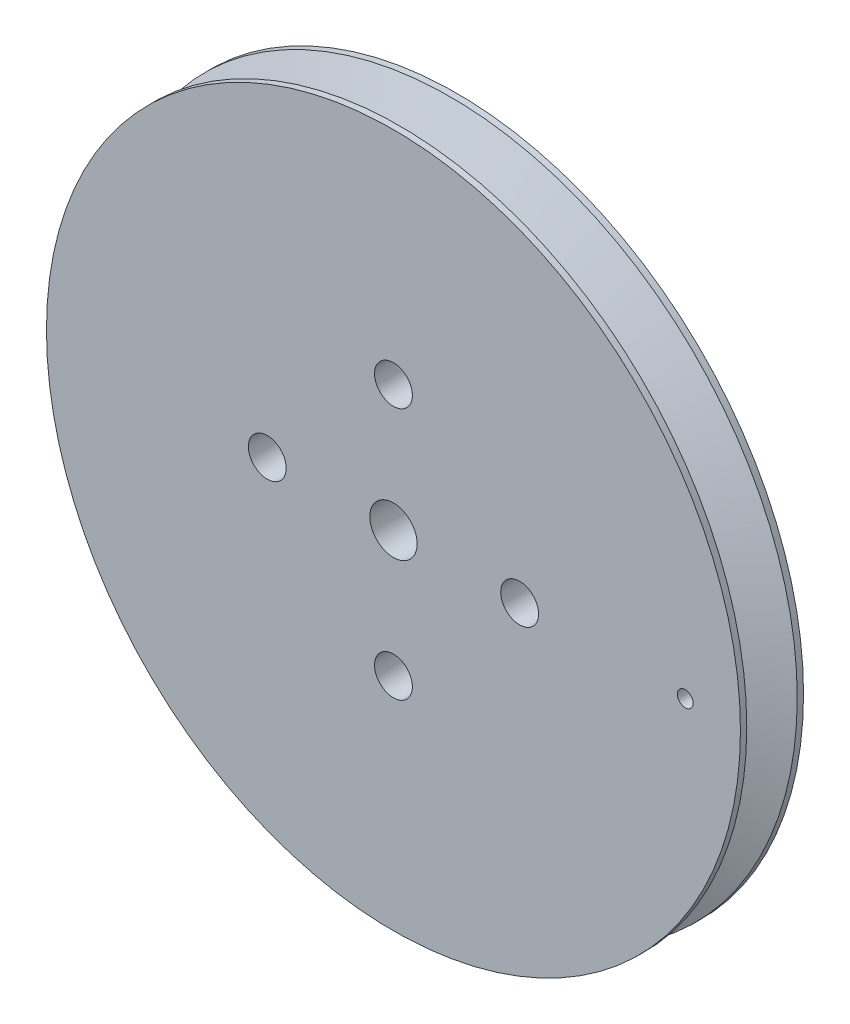
ISO-10303-21;
HEADER;
FILE_DESCRIPTION(('STEP AP214'),'2;1');
FILE_NAME('part.step','',(''),(''),'','','');
FILE_SCHEMA(('AUTOMOTIVE_DESIGN { 1 0 10303 214 1 1 1 1 }'));
ENDSEC;
DATA;
#1=APPLICATION_CONTEXT('core data for automotive mechanical design processes');
#2=APPLICATION_PROTOCOL_DEFINITION('international standard','automotive_design',2000,#1);
#3=PRODUCT_CONTEXT('',#1,'mechanical');
#4=PRODUCT('Part','Part','',(#3));
#5=PRODUCT_RELATED_PRODUCT_CATEGORY('part','',(#4));
#6=PRODUCT_DEFINITION_FORMATION('','',#4);
#7=PRODUCT_DEFINITION_CONTEXT('part definition',#1,'design');
#8=PRODUCT_DEFINITION('design','',#6,#7);
#9=PRODUCT_DEFINITION_SHAPE('','',#8);
#10=(LENGTH_UNIT() NAMED_UNIT(*) SI_UNIT(.MILLI.,.METRE.));
#11=(NAMED_UNIT(*) PLANE_ANGLE_UNIT() SI_UNIT($,.RADIAN.));
#12=(NAMED_UNIT(*) SI_UNIT($,.STERADIAN.) SOLID_ANGLE_UNIT());
#13=UNCERTAINTY_MEASURE_WITH_UNIT(LENGTH_MEASURE(1.E-05),#10,'distance_accuracy_value','');
#14=(GEOMETRIC_REPRESENTATION_CONTEXT(3) GLOBAL_UNCERTAINTY_ASSIGNED_CONTEXT((#13)) GLOBAL_UNIT_ASSIGNED_CONTEXT((#10,
#11,#12)) REPRESENTATION_CONTEXT('',''));
#15=CARTESIAN_POINT('',(0.,0.,0.));
#16=DIRECTION('',(0.,0.,1.));
#17=DIRECTION('',(1.,0.,0.));
#18=AXIS2_PLACEMENT_3D('',#15,#16,#17);
#19=CARTESIAN_POINT('',(0.,0.,24.87));
#20=DIRECTION('',(0.,0.,-1.));
#21=DIRECTION('',(-1.,0.,0.));
#22=AXIS2_PLACEMENT_3D('',#19,#20,#21);
#23=CYLINDRICAL_SURFACE('',#22,22.);
#24=CARTESIAN_POINT('',(0.,0.,24.87));
#25=DIRECTION('',(0.,0.,1.));
#26=DIRECTION('',(1.,0.,0.));
#27=AXIS2_PLACEMENT_3D('',#24,#25,#26);
#28=CIRCLE('',#27,22.);
#29=CARTESIAN_POINT('',(22.,0.,24.87));
#30=VERTEX_POINT('',#29);
#31=EDGE_CURVE('E45',#30,#30,#28,.T.);
#32=ORIENTED_EDGE('',*,*,#31,.F.);
#33=EDGE_LOOP('',(#32));
#34=FACE_BOUND('',#33,.T.);
#35=CARTESIAN_POINT('',(0.,0.,24.47));
#36=DIRECTION('',(0.,0.,1.));
#37=DIRECTION('',(1.,0.,0.));
#38=AXIS2_PLACEMENT_3D('',#35,#36,#37);
#39=CIRCLE('',#38,22.);
#40=CARTESIAN_POINT('',(22.,0.,24.47));
#41=VERTEX_POINT('',#40);
#42=EDGE_CURVE('E69',#41,#41,#39,.T.);
#43=ORIENTED_EDGE('',*,*,#42,.T.);
#44=EDGE_LOOP('',(#43));
#45=FACE_BOUND('',#44,.T.);
#46=ADVANCED_FACE('F35',(#34,#45),#23,.T.);
#47=CARTESIAN_POINT('',(0.,0.,20.87));
#48=DIRECTION('',(0.,0.,1.));
#49=DIRECTION('',(1.,0.,0.));
#50=AXIS2_PLACEMENT_3D('',#47,#48,#49);
#51=CIRCLE('',#50,22.);
#52=CARTESIAN_POINT('',(22.,0.,20.87));
#53=VERTEX_POINT('',#52);
#54=EDGE_CURVE('E100',#53,#53,#51,.T.);
#55=ORIENTED_EDGE('',*,*,#54,.T.);
#56=EDGE_LOOP('',(#55));
#57=FACE_BOUND('',#56,.T.);
#58=CARTESIAN_POINT('',(0.,0.,21.27));
#59=DIRECTION('',(0.,0.,1.));
#60=DIRECTION('',(1.,0.,0.));
#61=AXIS2_PLACEMENT_3D('',#58,#59,#60);
#62=CIRCLE('',#61,22.);
#63=CARTESIAN_POINT('',(22.,0.,21.27));
#64=VERTEX_POINT('',#63);
#65=EDGE_CURVE('E66',#64,#64,#62,.T.);
#66=ORIENTED_EDGE('',*,*,#65,.F.);
#67=EDGE_LOOP('',(#66));
#68=FACE_BOUND('',#67,.T.);
#69=ADVANCED_FACE('F105',(#57,#68),#23,.T.);
#70=CARTESIAN_POINT('',(0.,0.,24.87));
#71=DIRECTION('',(0.,0.,1.));
#72=DIRECTION('',(1.,0.,0.));
#73=AXIS2_PLACEMENT_3D('',#70,#71,#72);
#74=PLANE('',#73);
#75=CARTESIAN_POINT('',(0.,0.,24.87));
#76=DIRECTION('',(0.,0.,-1.));
#77=DIRECTION('',(-1.,0.,0.));
#78=AXIS2_PLACEMENT_3D('',#75,#76,#77);
#79=CIRCLE('',#78,1.5);
#80=CARTESIAN_POINT('',(-1.5,0.,24.87));
#81=VERTEX_POINT('',#80);
#82=EDGE_CURVE('E164',#81,#81,#79,.T.);
#83=ORIENTED_EDGE('',*,*,#82,.T.);
#84=EDGE_LOOP('',(#83));
#85=FACE_BOUND('',#84,.T.);
#86=CARTESIAN_POINT('',(18.5,0.,24.87));
#87=DIRECTION('',(0.,0.,1.));
#88=DIRECTION('',(1.,0.,0.));
#89=AXIS2_PLACEMENT_3D('',#86,#87,#88);
#90=CIRCLE('',#89,0.5);
#91=CARTESIAN_POINT('',(19.,0.,24.87));
#92=VERTEX_POINT('',#91);
#93=EDGE_CURVE('E56',#92,#92,#90,.T.);
#94=ORIENTED_EDGE('',*,*,#93,.F.);
#95=EDGE_LOOP('',(#94));
#96=FACE_BOUND('',#95,.T.);
#97=CARTESIAN_POINT('',(0.,8.,24.87));
#98=DIRECTION('',(0.,0.,-1.));
#99=DIRECTION('',(-1.,0.,0.));
#100=AXIS2_PLACEMENT_3D('',#97,#98,#99);
#101=CIRCLE('',#100,1.2);
#102=CARTESIAN_POINT('',(-1.2,8.,24.87));
#103=VERTEX_POINT('',#102);
#104=EDGE_CURVE('E79',#103,#103,#101,.T.);
#105=ORIENTED_EDGE('',*,*,#104,.T.);
#106=EDGE_LOOP('',(#105));
#107=FACE_BOUND('',#106,.T.);
#108=CARTESIAN_POINT('',(8.,0.,24.87));
#109=DIRECTION('',(0.,0.,-1.));
#110=DIRECTION('',(-1.,0.,0.));
#111=AXIS2_PLACEMENT_3D('',#108,#109,#110);
#112=CIRCLE('',#111,1.2);
#113=CARTESIAN_POINT('',(6.8,0.,24.87));
#114=VERTEX_POINT('',#113);
#115=EDGE_CURVE('E85',#114,#114,#112,.T.);
#116=ORIENTED_EDGE('',*,*,#115,.T.);
#117=EDGE_LOOP('',(#116));
#118=FACE_BOUND('',#117,.T.);
#119=CARTESIAN_POINT('',(0.,-8.,24.87));
#120=DIRECTION('',(0.,0.,-1.));
#121=DIRECTION('',(-1.,0.,0.));
#122=AXIS2_PLACEMENT_3D('',#119,#120,#121);
#123=CIRCLE('',#122,1.2);
#124=CARTESIAN_POINT('',(-1.2,-8.,24.87));
#125=VERTEX_POINT('',#124);
#126=EDGE_CURVE('E91',#125,#125,#123,.T.);
#127=ORIENTED_EDGE('',*,*,#126,.T.);
#128=EDGE_LOOP('',(#127));
#129=FACE_BOUND('',#128,.T.);
#130=CARTESIAN_POINT('',(-8.,0.,24.87));
#131=DIRECTION('',(0.,0.,-1.));
#132=DIRECTION('',(-1.,0.,0.));
#133=AXIS2_PLACEMENT_3D('',#130,#131,#132);
#134=CIRCLE('',#133,1.2);
#135=CARTESIAN_POINT('',(-9.2,0.,24.87));
#136=VERTEX_POINT('',#135);
#137=EDGE_CURVE('E97',#136,#136,#134,.T.);
#138=ORIENTED_EDGE('',*,*,#137,.T.);
#139=EDGE_LOOP('',(#138));
#140=FACE_BOUND('',#139,.T.);
#141=ORIENTED_EDGE('',*,*,#31,.T.);
#142=EDGE_LOOP('',(#141));
#143=FACE_BOUND('',#142,.T.);
#144=ADVANCED_FACE('F111',(#85,#96,#107,#118,#129,#140,#143),#74,.T.);
#145=CARTESIAN_POINT('',(0.,0.,20.87));
#146=DIRECTION('',(0.,0.,1.));
#147=DIRECTION('',(1.,0.,0.));
#148=AXIS2_PLACEMENT_3D('',#145,#146,#147);
#149=PLANE('',#148);
#150=CARTESIAN_POINT('',(0.,0.,20.87));
#151=DIRECTION('',(0.,0.,-1.));
#152=DIRECTION('',(-1.,0.,0.));
#153=AXIS2_PLACEMENT_3D('',#150,#151,#152);
#154=CIRCLE('',#153,1.5);
#155=CARTESIAN_POINT('',(-1.5,0.,20.87));
#156=VERTEX_POINT('',#155);
#157=EDGE_CURVE('E166',#156,#156,#154,.T.);
#158=ORIENTED_EDGE('',*,*,#157,.F.);
#159=EDGE_LOOP('',(#158));
#160=FACE_BOUND('',#159,.T.);
#161=CARTESIAN_POINT('',(18.5,0.,20.87));
#162=DIRECTION('',(0.,0.,1.));
#163=DIRECTION('',(1.,0.,0.));
#164=AXIS2_PLACEMENT_3D('',#161,#162,#163);
#165=CIRCLE('',#164,0.499999999999999);
#166=CARTESIAN_POINT('',(19.,0.,20.87));
#167=VERTEX_POINT('',#166);
#168=EDGE_CURVE('E55',#167,#167,#165,.T.);
#169=ORIENTED_EDGE('',*,*,#168,.T.);
#170=EDGE_LOOP('',(#169));
#171=FACE_BOUND('',#170,.T.);
#172=CARTESIAN_POINT('',(0.,8.,20.87));
#173=DIRECTION('',(0.,0.,-1.));
#174=DIRECTION('',(-1.,0.,0.));
#175=AXIS2_PLACEMENT_3D('',#172,#173,#174);
#176=CIRCLE('',#175,1.19999999999999);
#177=CARTESIAN_POINT('',(-1.19999999999999,8.,20.87));
#178=VERTEX_POINT('',#177);
#179=EDGE_CURVE('E76',#178,#178,#176,.T.);
#180=ORIENTED_EDGE('',*,*,#179,.F.);
#181=EDGE_LOOP('',(#180));
#182=FACE_BOUND('',#181,.T.);
#183=CARTESIAN_POINT('',(8.,0.,20.87));
#184=DIRECTION('',(0.,0.,-1.));
#185=DIRECTION('',(-1.,0.,0.));
#186=AXIS2_PLACEMENT_3D('',#183,#184,#185);
#187=CIRCLE('',#186,1.19999999999999);
#188=CARTESIAN_POINT('',(6.80000000000001,0.,20.87));
#189=VERTEX_POINT('',#188);
#190=EDGE_CURVE('E82',#189,#189,#187,.T.);
#191=ORIENTED_EDGE('',*,*,#190,.F.);
#192=EDGE_LOOP('',(#191));
#193=FACE_BOUND('',#192,.T.);
#194=CARTESIAN_POINT('',(0.,-8.,20.87));
#195=DIRECTION('',(0.,0.,-1.));
#196=DIRECTION('',(-1.,0.,0.));
#197=AXIS2_PLACEMENT_3D('',#194,#195,#196);
#198=CIRCLE('',#197,1.19999999999999);
#199=CARTESIAN_POINT('',(-1.19999999999999,-8.,20.87));
#200=VERTEX_POINT('',#199);
#201=EDGE_CURVE('E88',#200,#200,#198,.T.);
#202=ORIENTED_EDGE('',*,*,#201,.F.);
#203=EDGE_LOOP('',(#202));
#204=FACE_BOUND('',#203,.T.);
#205=CARTESIAN_POINT('',(-8.,0.,20.87));
#206=DIRECTION('',(0.,0.,-1.));
#207=DIRECTION('',(-1.,0.,0.));
#208=AXIS2_PLACEMENT_3D('',#205,#206,#207);
#209=CIRCLE('',#208,1.19999999999999);
#210=CARTESIAN_POINT('',(-9.19999999999999,0.,20.87));
#211=VERTEX_POINT('',#210);
#212=EDGE_CURVE('E94',#211,#211,#209,.T.);
#213=ORIENTED_EDGE('',*,*,#212,.F.);
#214=EDGE_LOOP('',(#213));
#215=FACE_BOUND('',#214,.T.);
#216=ORIENTED_EDGE('',*,*,#54,.F.);
#217=EDGE_LOOP('',(#216));
#218=FACE_BOUND('',#217,.T.);
#219=ADVANCED_FACE('F108',(#160,#171,#182,#193,#204,#215,#218),#149,.F.);
#220=CARTESIAN_POINT('',(-8.,0.,20.87));
#221=DIRECTION('',(0.,0.,-1.));
#222=DIRECTION('',(-1.,0.,0.));
#223=AXIS2_PLACEMENT_3D('',#220,#221,#222);
#224=CYLINDRICAL_SURFACE('',#223,1.19999999999999);
#225=ORIENTED_EDGE('',*,*,#137,.F.);
#226=EDGE_LOOP('',(#225));
#227=FACE_BOUND('',#226,.T.);
#228=ORIENTED_EDGE('',*,*,#212,.T.);
#229=EDGE_LOOP('',(#228));
#230=FACE_BOUND('',#229,.T.);
#231=ADVANCED_FACE('F110',(#227,#230),#224,.F.);
#232=CARTESIAN_POINT('',(0.,-8.,20.87));
#233=DIRECTION('',(0.,0.,-1.));
#234=DIRECTION('',(-1.,0.,0.));
#235=AXIS2_PLACEMENT_3D('',#232,#233,#234);
#236=CYLINDRICAL_SURFACE('',#235,1.19999999999999);
#237=ORIENTED_EDGE('',*,*,#126,.F.);
#238=EDGE_LOOP('',(#237));
#239=FACE_BOUND('',#238,.T.);
#240=ORIENTED_EDGE('',*,*,#201,.T.);
#241=EDGE_LOOP('',(#240));
#242=FACE_BOUND('',#241,.T.);
#243=ADVANCED_FACE('F117',(#239,#242),#236,.F.);
#244=CARTESIAN_POINT('',(8.,0.,20.87));
#245=DIRECTION('',(0.,0.,-1.));
#246=DIRECTION('',(-1.,0.,0.));
#247=AXIS2_PLACEMENT_3D('',#244,#245,#246);
#248=CYLINDRICAL_SURFACE('',#247,1.19999999999999);
#249=ORIENTED_EDGE('',*,*,#115,.F.);
#250=EDGE_LOOP('',(#249));
#251=FACE_BOUND('',#250,.T.);
#252=ORIENTED_EDGE('',*,*,#190,.T.);
#253=EDGE_LOOP('',(#252));
#254=FACE_BOUND('',#253,.T.);
#255=ADVANCED_FACE('F141',(#251,#254),#248,.F.);
#256=CARTESIAN_POINT('',(0.,8.,20.87));
#257=DIRECTION('',(0.,0.,-1.));
#258=DIRECTION('',(-1.,0.,0.));
#259=AXIS2_PLACEMENT_3D('',#256,#257,#258);
#260=CYLINDRICAL_SURFACE('',#259,1.19999999999999);
#261=ORIENTED_EDGE('',*,*,#104,.F.);
#262=EDGE_LOOP('',(#261));
#263=FACE_BOUND('',#262,.T.);
#264=ORIENTED_EDGE('',*,*,#179,.T.);
#265=EDGE_LOOP('',(#264));
#266=FACE_BOUND('',#265,.T.);
#267=ADVANCED_FACE('F134',(#263,#266),#260,.F.);
#268=CARTESIAN_POINT('',(0.,0.,24.47));
#269=DIRECTION('',(0.,0.,1.));
#270=DIRECTION('',(1.,0.,0.));
#271=AXIS2_PLACEMENT_3D('',#268,#269,#270);
#272=CONICAL_SURFACE('',#271,22.,1.19028994968253);
#273=CARTESIAN_POINT('',(0.,0.,22.87));
#274=DIRECTION('',(0.,0.,1.));
#275=DIRECTION('',(1.,0.,0.));
#276=AXIS2_PLACEMENT_3D('',#273,#274,#275);
#277=CIRCLE('',#276,18.);
#278=CARTESIAN_POINT('',(18.,0.,22.87));
#279=VERTEX_POINT('',#278);
#280=EDGE_CURVE('E63',#279,#279,#277,.T.);
#281=ORIENTED_EDGE('',*,*,#280,.T.);
#282=CARTESIAN_POINT('',(18.1737789206432,-0.37891949185284,22.9410916623354));
#283=CARTESIAN_POINT('',(18.1533441479865,-0.361325883759361,22.932772853103));
#284=CARTESIAN_POINT('',(18.1342055174644,-0.341964826451125,22.9249671639955));
#285=CARTESIAN_POINT('',(18.0991357520371,-0.300089992922861,22.9106446075082));
#286=CARTESIAN_POINT('',(18.0832061080483,-0.277574759450061,22.9041283392266));
#287=CARTESIAN_POINT('',(18.0551050043247,-0.229862196538675,22.8926210731604));
#288=CARTESIAN_POINT('',(18.0429435031962,-0.204657992682623,22.8876341174578));
#289=CARTESIAN_POINT('',(18.0229439116517,-0.152320548266965,22.8794275026932));
#290=CARTESIAN_POINT('',(18.0151042651792,-0.125188005970704,22.8762072075583));
#291=CARTESIAN_POINT('',(18.0043617242058,-0.0711659094030204,22.8717932547474));
#292=CARTESIAN_POINT('',(18.0012400766079,-0.0443271213299626,22.8705097989694));
#293=CARTESIAN_POINT('',(17.9993656672773,0.0095259576841013,22.8697392269185));
#294=CARTESIAN_POINT('',(18.000612031188,0.0365402124209412,22.8702517511394));
#295=CARTESIAN_POINT('',(18.0073044694458,0.0890427737171426,22.8730024428327));
#296=CARTESIAN_POINT('',(18.0126112636795,0.114552057456892,22.8751833802657));
#297=CARTESIAN_POINT('',(18.0270460887139,0.164270465301889,22.8811109789762));
#298=CARTESIAN_POINT('',(18.0361742329836,0.188479550775705,22.8848576867466));
#299=CARTESIAN_POINT('',(18.0581070991197,0.235400034406832,22.8938503916868));
#300=CARTESIAN_POINT('',(18.0709737305095,0.258077553744584,22.8991216277071));
#301=CARTESIAN_POINT('',(18.0998714663263,0.30094150907881,22.9109442716056));
#302=CARTESIAN_POINT('',(18.1159032782861,0.32112738646022,22.9174959657092));
#303=CARTESIAN_POINT('',(18.1516447918644,0.359692949983211,22.9320791246179));
#304=CARTESIAN_POINT('',(18.1715133430278,0.377901191933174,22.9401741636079));
#305=CARTESIAN_POINT('',(18.2136452929368,0.41074961638939,22.9573077013914));
#306=CARTESIAN_POINT('',(18.2359094512816,0.425388662340984,22.9663464994049));
#307=CARTESIAN_POINT('',(18.2839377663256,0.451798315777595,22.9858056863898));
#308=CARTESIAN_POINT('',(18.309838784278,0.463281373456135,22.9962787654997));
#309=CARTESIAN_POINT('',(18.3630139627331,0.48169199930953,23.0177314745349));
#310=CARTESIAN_POINT('',(18.3902885532516,0.488618131211563,23.0287112630015));
#311=CARTESIAN_POINT('',(18.4471620409751,0.498083647034331,23.0515538447748));
#312=CARTESIAN_POINT('',(18.4768029559812,0.500339099084962,23.0634304347417));
#313=CARTESIAN_POINT('',(18.5360503195018,0.499578294217781,23.087112525654));
#314=CARTESIAN_POINT('',(18.5656567600821,0.496560999374926,23.0989180121439));
#315=CARTESIAN_POINT('',(18.6246191163417,0.485169845351742,23.1223744865601));
#316=CARTESIAN_POINT('',(18.6539574811871,0.476687541258044,23.1340173577979));
#317=CARTESIAN_POINT('',(18.7108538879951,0.454393907900064,23.1565467322637));
#318=CARTESIAN_POINT('',(18.7384120601219,0.440582968771269,23.1674332907962));
#319=CARTESIAN_POINT('',(18.7900760487474,0.40835818377948,23.1878022812799));
#320=CARTESIAN_POINT('',(18.8142574428706,0.39008551057027,23.1973157090224));
#321=CARTESIAN_POINT('',(18.8591792616297,0.349159378397553,23.2149598517887));
#322=CARTESIAN_POINT('',(18.8799210551648,0.32650767002241,23.223091116921));
#323=CARTESIAN_POINT('',(18.9159049548152,0.279020910648886,23.2371793883218));
#324=CARTESIAN_POINT('',(18.9314156163999,0.254421133059666,23.2432428526859));
#325=CARTESIAN_POINT('',(18.9580343299592,0.202611463207265,23.2536396554219));
#326=CARTESIAN_POINT('',(18.9691445355342,0.175402855834206,23.2579738401177));
#327=CARTESIAN_POINT('',(18.9858586460205,0.121199602561178,23.2644909702449));
#328=CARTESIAN_POINT('',(18.9917917245291,0.0943216465486664,23.2668025505481));
#329=CARTESIAN_POINT('',(18.9991641072592,0.0398668023840687,23.2696745756912));
#330=CARTESIAN_POINT('',(19.0006047476983,0.0122901245184505,23.2702355412288));
#331=CARTESIAN_POINT('',(18.9989678324836,-0.0415466639133411,23.2695979892866));
#332=CARTESIAN_POINT('',(18.9960768679685,-0.0678135681367439,23.2684721345104));
#333=CARTESIAN_POINT('',(18.9862324662405,-0.119451943725096,23.264636254395));
#334=CARTESIAN_POINT('',(18.9792792070758,-0.144823454283016,23.2619262984862));
#335=CARTESIAN_POINT('',(18.9615583487682,-0.194034476084642,23.2550139946315));
#336=CARTESIAN_POINT('',(18.950783105104,-0.217870803007754,23.2508086556607));
#337=CARTESIAN_POINT('',(18.9258059171097,-0.263368935836841,23.241049778965));
#338=CARTESIAN_POINT('',(18.9116034406347,-0.285030403313049,23.2354960318725));
#339=CARTESIAN_POINT('',(18.8795704908102,-0.326561761012574,23.2229529429959));
#340=CARTESIAN_POINT('',(18.8616124091529,-0.346317770012002,23.2159129893768));
#341=CARTESIAN_POINT('',(18.8230399717887,-0.382551983498496,23.2007671554788));
#342=CARTESIAN_POINT('',(18.8024248834108,-0.399029280678967,23.1926609811764));
#343=CARTESIAN_POINT('',(18.7576975393499,-0.429382313435742,23.1750417633012));
#344=CARTESIAN_POINT('',(18.7334447855242,-0.443017683336865,23.1654714003055));
#345=CARTESIAN_POINT('',(18.6832639374606,-0.46602238207083,23.1456284684445));
#346=CARTESIAN_POINT('',(18.6573353852402,-0.47539053903079,23.1353557075746));
#347=CARTESIAN_POINT('',(18.6027515430738,-0.4901962753012,23.1136828150717));
#348=CARTESIAN_POINT('',(18.5740283609287,-0.495340424645791,23.1022527415504));
#349=CARTESIAN_POINT('',(18.5161965371814,-0.500580992035965,23.0791846145044));
#350=CARTESIAN_POINT('',(18.4870877146505,-0.500674950304301,23.0675464623921));
#351=CARTESIAN_POINT('',(18.4281192057802,-0.495724280027422,23.0439142012457));
#352=CARTESIAN_POINT('',(18.3982746843462,-0.490478515501902,23.0319239747464));
#353=CARTESIAN_POINT('',(18.3398737231353,-0.474629637038246,23.0084051761323));
#354=CARTESIAN_POINT('',(18.311316010772,-0.464031948417491,22.9968761492408));
#355=CARTESIAN_POINT('',(18.2641774815762,-0.441434043887511,22.9778036488883));
#356=CARTESIAN_POINT('',(18.2450678459606,-0.430688420023671,22.9700586842024));
#357=CARTESIAN_POINT('',(18.2082729209576,-0.406666751292639,22.95512402566));
#358=CARTESIAN_POINT('',(18.1905874483024,-0.393391032751997,22.9479342603629));
#359=CARTESIAN_POINT('',(18.1737789206432,-0.37891949185284,22.9410916623354));
#360=B_SPLINE_CURVE_WITH_KNOTS('',3,(#282,#283,#284,#285,#286,#287,#288,#289,#290,#291,#292,
#293,#294,#295,#296,#297,#298,#299,#300,#301,#302,#303,#304,#305,#306,#307,#308,#309,#310,#311,
#312,#313,#314,#315,#316,#317,#318,#319,#320,#321,#322,#323,#324,#325,#326,#327,#328,#329,#330,
#331,#332,#333,#334,#335,#336,#337,#338,#339,#340,#341,#342,#343,#344,#345,#346,#347,#348,#349,
#350,#351,#352,#353,#354,#355,#356,#357,#358,#359),.UNSPECIFIED.,.T.,.F.,(4,2,2,2,2,2,2,2,2,2,2,
2,2,2,2,2,2,2,2,2,2,2,2,2,2,2,2,2,2,2,2,2,2,2,2,2,2,2,4),(0.,0.0845811671748811,
0.169201541145652,0.254043682526919,0.338855257048908,0.419598884880451,0.500326350962428,
0.57840239781788,0.656480763183395,0.735933989418831,0.815404996485026,0.899461909501051,
0.983545554270058,1.07376969556397,1.16402226051199,1.25961713232814,1.35523082383931,
1.45280283030605,1.55036769440314,1.64517420269979,1.73994288868223,1.82859507772586,
1.91720382627059,1.99965089446044,2.08207343749726,2.16104607601921,2.24001525347017,
2.31914327971633,2.39828360004881,2.48075710281204,2.56325339654004,2.65114056817581,
2.73905186108045,2.83264940165706,2.92629253001675,3.02359844387711,3.12080591483546,
3.19038673071015,3.2599585782565),.UNSPECIFIED.);
#361=EDGE_CURVE('E49',#279,#279,#360,.T.);
#362=ORIENTED_EDGE('',*,*,#361,.F.);
#363=EDGE_LOOP('',(#281,#362));
#364=FACE_BOUND('',#363,.T.);
#365=ORIENTED_EDGE('',*,*,#42,.F.);
#366=EDGE_LOOP('',(#365));
#367=FACE_BOUND('',#366,.T.);
#368=ADVANCED_FACE('F64',(#364,#367),#272,.T.);
#369=CARTESIAN_POINT('',(0.,0.,22.87));
#370=DIRECTION('',(0.,0.,-1.));
#371=DIRECTION('',(-1.,0.,0.));
#372=AXIS2_PLACEMENT_3D('',#369,#370,#371);
#373=CONICAL_SURFACE('',#372,18.,1.19028994968253);
#374=ORIENTED_EDGE('',*,*,#65,.T.);
#375=EDGE_LOOP('',(#374));
#376=FACE_BOUND('',#375,.T.);
#377=ORIENTED_EDGE('',*,*,#280,.F.);
#378=CARTESIAN_POINT('',(18.1737789206432,-0.378919491852839,22.7989083376646));
#379=CARTESIAN_POINT('',(18.1963915490449,-0.398385537249941,22.7897028555819));
#380=CARTESIAN_POINT('',(18.2206268135587,-0.415715540568842,22.7798547378357));
#381=CARTESIAN_POINT('',(18.271508271563,-0.445721189197535,22.7592247636986));
#382=CARTESIAN_POINT('',(18.2981595208615,-0.458386779633743,22.7484409513448));
#383=CARTESIAN_POINT('',(18.3529723573991,-0.478785052540456,22.7263143715805));
#384=CARTESIAN_POINT('',(18.3811295940286,-0.486531191897284,22.7149732212184));
#385=CARTESIAN_POINT('',(18.4382380554461,-0.497019495041618,22.6920259653126));
#386=CARTESIAN_POINT('',(18.4671889837008,-0.499763502508496,22.6804199589869));
#387=CARTESIAN_POINT('',(18.5262275934495,-0.500215399643043,22.6568082581834));
#388=CARTESIAN_POINT('',(18.5563174368071,-0.497731830090399,22.6448037843819));
#389=CARTESIAN_POINT('',(18.6157111302733,-0.487360131170488,22.6211645417882));
#390=CARTESIAN_POINT('',(18.6450148250116,-0.479470941523715,22.6095298459942));
#391=CARTESIAN_POINT('',(18.7019200846009,-0.458418268556027,22.586986312215));
#392=CARTESIAN_POINT('',(18.7295237956544,-0.445261599660407,22.5760765575685));
#393=CARTESIAN_POINT('',(18.782158029024,-0.413913417797366,22.5553154855261));
#394=CARTESIAN_POINT('',(18.8071891622551,-0.395723103985448,22.5454639168156));
#395=CARTESIAN_POINT('',(18.8526402263591,-0.355693774941317,22.5276060664706));
#396=CARTESIAN_POINT('',(18.8732225461084,-0.334068713911031,22.5195344291979));
#397=CARTESIAN_POINT('',(18.9104026814524,-0.28716514212744,22.5049727672586));
#398=CARTESIAN_POINT('',(18.9270024234825,-0.261888407264866,22.498481977888));
#399=CARTESIAN_POINT('',(18.9544751675288,-0.210342298517169,22.4877496850493));
#400=CARTESIAN_POINT('',(18.9656718763846,-0.184271895615895,22.4833808920396));
#401=CARTESIAN_POINT('',(18.9835290470195,-0.130398738268346,22.4764169046658));
#402=CARTESIAN_POINT('',(18.9901914328573,-0.102596724073547,22.4738209580245));
#403=CARTESIAN_POINT('',(18.9984254731291,-0.0478676442042466,22.4706131038714));
#404=CARTESIAN_POINT('',(19.0002806965021,-0.0209893865348617,22.4698906771796));
#405=CARTESIAN_POINT('',(18.9996506627825,0.0327059070513327,22.4701360565965));
#406=CARTESIAN_POINT('',(18.9971661927584,0.0595229531865442,22.4711035562117));
#407=CARTESIAN_POINT('',(18.9880672044405,0.111694789282466,22.474648735247));
#408=CARTESIAN_POINT('',(18.9815486982688,0.13706900898844,22.4771889830587));
#409=CARTESIAN_POINT('',(18.9647176317946,0.186319352902353,22.483753294279));
#410=CARTESIAN_POINT('',(18.9544048632032,0.210195394782501,22.4877774391471));
#411=CARTESIAN_POINT('',(18.9300937802749,0.256347697556154,22.4972740639234));
#412=CARTESIAN_POINT('',(18.9160213425867,0.278578808655246,22.5027756856698));
#413=CARTESIAN_POINT('',(18.8847753706049,0.320357435317196,22.5150077742819));
#414=CARTESIAN_POINT('',(18.8676011630938,0.339904366673008,22.5217385079213));
#415=CARTESIAN_POINT('',(18.8296511787429,0.376922794103544,22.5366346609732));
#416=CARTESIAN_POINT('',(18.8087290666829,0.394220515205367,22.5448587090872));
#417=CARTESIAN_POINT('',(18.7646345820777,0.425080483601449,22.5622232241742));
#418=CARTESIAN_POINT('',(18.7414615354348,0.438641607186062,22.5713639657002));
#419=CARTESIAN_POINT('',(18.6918408508234,0.46260881014545,22.590975981772));
#420=CARTESIAN_POINT('',(18.6652776624386,0.472736341588176,22.6014954878377));
#421=CARTESIAN_POINT('',(18.6110114605796,0.488338224122577,22.6230339122602));
#422=CARTESIAN_POINT('',(18.5833081053641,0.493811169291701,22.6340529804525));
#423=CARTESIAN_POINT('',(18.5258933882042,0.500209699588091,22.6569421352018));
#424=CARTESIAN_POINT('',(18.4961565966317,0.500862806712973,22.668825273615));
#425=CARTESIAN_POINT('',(18.4370025648218,0.49690084387161,22.6925210505047));
#426=CARTESIAN_POINT('',(18.4075853896375,0.492284720985258,22.7043336744165));
#427=CARTESIAN_POINT('',(18.3493065384414,0.477714664047546,22.7277908678616));
#428=CARTESIAN_POINT('',(18.3204675607986,0.467656352186191,22.739427417251));
#429=CARTESIAN_POINT('',(18.2648485074093,0.442309161863938,22.7619202456133));
#430=CARTESIAN_POINT('',(18.2380682894256,0.427020645150156,22.772776578487));
#431=CARTESIAN_POINT('',(18.1882234592071,0.392039587136236,22.7930238076547));
#432=CARTESIAN_POINT('',(18.1650728612501,0.372489478222174,22.8024483633091));
#433=CARTESIAN_POINT('',(18.1224332980891,0.329188886856592,22.8198358064959));
#434=CARTESIAN_POINT('',(18.1029427301089,0.305440251883323,22.8277993337969));
#435=CARTESIAN_POINT('',(18.0696429275483,0.256155638273443,22.8414227192631));
#436=CARTESIAN_POINT('',(18.0555350848308,0.230855024485648,22.847203370892));
#437=CARTESIAN_POINT('',(18.0318208935253,0.177900270402095,22.8569282872525));
#438=CARTESIAN_POINT('',(18.0222121309828,0.150247401628226,22.8608735367508));
#439=CARTESIAN_POINT('',(18.0084758620525,0.0955957271069052,22.8665158087068));
#440=CARTESIAN_POINT('',(18.0039948558289,0.06870037569542,22.8683578026186));
#441=CARTESIAN_POINT('',(17.9994706762599,0.0144804797447367,22.8702175491088));
#442=CARTESIAN_POINT('',(17.9994259846358,-0.0128439147572455,22.8702359257995));
#443=CARTESIAN_POINT('',(18.0036832302875,-0.0659593892517741,22.868485897803));
#444=CARTESIAN_POINT('',(18.0078072639393,-0.0917674407048518,22.8667906244668));
#445=CARTESIAN_POINT('',(18.0199692795652,-0.14228714830516,22.8617946540338));
#446=CARTESIAN_POINT('',(18.028008350057,-0.166998497444421,22.8584935104488));
#447=CARTESIAN_POINT('',(18.0477992688399,-0.214928890385447,22.8503747873187));
#448=CARTESIAN_POINT('',(18.0595900363364,-0.238129072855873,22.8455413137661));
#449=CARTESIAN_POINT('',(18.0864325369064,-0.282180984949598,22.8345517962459));
#450=CARTESIAN_POINT('',(18.1014807267958,-0.303035229148061,22.8283971893702));
#451=CARTESIAN_POINT('',(18.1265086113391,-0.332689622990544,22.8181765654727));
#452=CARTESIAN_POINT('',(18.135485566146,-0.342497573562381,22.8145132221305));
#453=CARTESIAN_POINT('',(18.1541292819771,-0.361315566398528,22.8069110969843));
#454=CARTESIAN_POINT('',(18.1637959741256,-0.370325688131505,22.8029723426829));
#455=CARTESIAN_POINT('',(18.1737789206432,-0.378919491852839,22.7989083376646));
#456=B_SPLINE_CURVE_WITH_KNOTS('',3,(#378,#379,#380,#381,#382,#383,#384,#385,#386,#387,#388,
#389,#390,#391,#392,#393,#394,#395,#396,#397,#398,#399,#400,#401,#402,#403,#404,#405,#406,#407,
#408,#409,#410,#411,#412,#413,#414,#415,#416,#417,#418,#419,#420,#421,#422,#423,#424,#425,#426,
#427,#428,#429,#430,#431,#432,#433,#434,#435,#436,#437,#438,#439,#440,#441,#442,#443,#444,#445,
#446,#447,#448,#449,#450,#451,#452,#453,#454,#455),.UNSPECIFIED.,.T.,.F.,(4,2,2,2,2,2,2,2,2,2,2,
2,2,2,2,2,2,2,2,2,2,2,2,2,2,2,2,2,2,2,2,2,2,2,2,2,2,2,4),(0.,0.0936217575444187,
0.187444166258947,0.281008810809045,0.374538962444032,0.471554117930701,0.568588307799378,
0.665497370148962,0.762383365885467,0.854674504599582,0.946920910221047,1.03259623466407,
1.11823518161326,1.1986936581021,1.27913754375172,1.3577367787244,1.43634032910243,
1.51662540204518,1.59692792129198,1.6816565106092,1.76641055267435,1.85694986401821,
1.94751651315093,2.04316652352266,2.13883565043549,2.23640828482373,2.33397417196471,
2.42867641948648,2.52333709841261,2.61148544347671,2.69958643872651,2.78115700809393,
2.86269966075781,2.94090344007007,3.01912897520739,3.09819401752388,3.17717348703219,
3.21850942508017,3.25984124117173),.UNSPECIFIED.);
#457=EDGE_CURVE('E11',#279,#279,#456,.T.);
#458=ORIENTED_EDGE('',*,*,#457,.F.);
#459=EDGE_LOOP('',(#377,#458));
#460=FACE_BOUND('',#459,.T.);
#461=ADVANCED_FACE('F133',(#376,#460),#373,.T.);
#462=CARTESIAN_POINT('',(18.5,0.,24.87));
#463=DIRECTION('',(0.,0.,1.));
#464=DIRECTION('',(1.,0.,0.));
#465=AXIS2_PLACEMENT_3D('',#462,#463,#464);
#466=CYLINDRICAL_SURFACE('',#465,0.499999999999999);
#467=ORIENTED_EDGE('',*,*,#457,.T.);
#468=EDGE_LOOP('',(#467));
#469=FACE_BOUND('',#468,.T.);
#470=ORIENTED_EDGE('',*,*,#168,.F.);
#471=EDGE_LOOP('',(#470));
#472=FACE_BOUND('',#471,.T.);
#473=ADVANCED_FACE('F60',(#469,#472),#466,.F.);
#474=ORIENTED_EDGE('',*,*,#361,.T.);
#475=EDGE_LOOP('',(#474));
#476=FACE_BOUND('',#475,.T.);
#477=ORIENTED_EDGE('',*,*,#93,.T.);
#478=EDGE_LOOP('',(#477));
#479=FACE_BOUND('',#478,.T.);
#480=ADVANCED_FACE('F50',(#476,#479),#466,.F.);
#481=CARTESIAN_POINT('',(0.,0.,20.87));
#482=DIRECTION('',(0.,0.,-1.));
#483=DIRECTION('',(-1.,0.,0.));
#484=AXIS2_PLACEMENT_3D('',#481,#482,#483);
#485=CYLINDRICAL_SURFACE('',#484,1.5);
#486=ORIENTED_EDGE('',*,*,#82,.F.);
#487=EDGE_LOOP('',(#486));
#488=FACE_BOUND('',#487,.T.);
#489=ORIENTED_EDGE('',*,*,#157,.T.);
#490=EDGE_LOOP('',(#489));
#491=FACE_BOUND('',#490,.T.);
#492=ADVANCED_FACE('F154',(#488,#491),#485,.F.);
#493=CLOSED_SHELL('',(#46,#69,#144,#219,#231,#243,#255,#267,#368,#461,#473,#480,#492));
#494=MANIFOLD_SOLID_BREP('B2',#493);
#495=ADVANCED_BREP_SHAPE_REPRESENTATION('',(#18,#494),#14);
#496=SHAPE_DEFINITION_REPRESENTATION(#9,#495);
ENDSEC;
END-ISO-10303-21;
